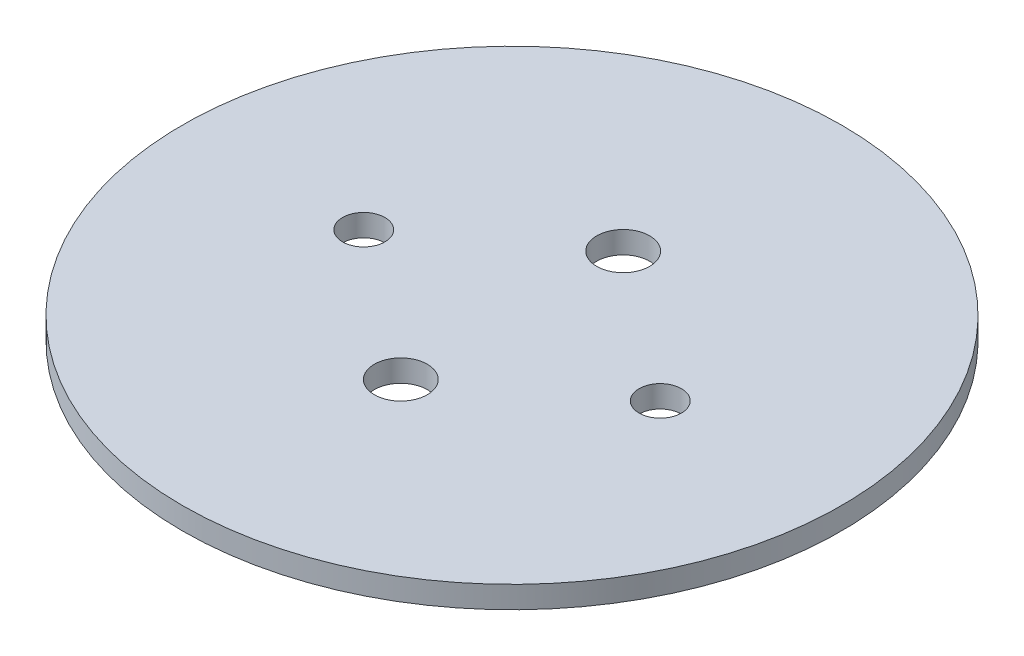
ISO-10303-21;
HEADER;
FILE_DESCRIPTION(('STEP AP214'),'2;1');
FILE_NAME('part.step','',(''),(''),'','','');
FILE_SCHEMA(('AUTOMOTIVE_DESIGN { 1 0 10303 214 1 1 1 1 }'));
ENDSEC;
DATA;
#1=APPLICATION_CONTEXT('core data for automotive mechanical design processes');
#2=APPLICATION_PROTOCOL_DEFINITION('international standard','automotive_design',2000,#1);
#3=PRODUCT_CONTEXT('',#1,'mechanical');
#4=PRODUCT('Part','Part','',(#3));
#5=PRODUCT_RELATED_PRODUCT_CATEGORY('part','',(#4));
#6=PRODUCT_DEFINITION_FORMATION('','',#4);
#7=PRODUCT_DEFINITION_CONTEXT('part definition',#1,'design');
#8=PRODUCT_DEFINITION('design','',#6,#7);
#9=PRODUCT_DEFINITION_SHAPE('','',#8);
#10=(LENGTH_UNIT() NAMED_UNIT(*) SI_UNIT(.MILLI.,.METRE.));
#11=(NAMED_UNIT(*) PLANE_ANGLE_UNIT() SI_UNIT($,.RADIAN.));
#12=(NAMED_UNIT(*) SI_UNIT($,.STERADIAN.) SOLID_ANGLE_UNIT());
#13=UNCERTAINTY_MEASURE_WITH_UNIT(LENGTH_MEASURE(1.E-05),#10,'distance_accuracy_value','');
#14=(GEOMETRIC_REPRESENTATION_CONTEXT(3) GLOBAL_UNCERTAINTY_ASSIGNED_CONTEXT((#13)) GLOBAL_UNIT_ASSIGNED_CONTEXT((#10,
#11,#12)) REPRESENTATION_CONTEXT('',''));
#15=CARTESIAN_POINT('',(0.,0.,0.));
#16=DIRECTION('',(0.,0.,1.));
#17=DIRECTION('',(1.,0.,0.));
#18=AXIS2_PLACEMENT_3D('',#15,#16,#17);
#19=CARTESIAN_POINT('',(0.,3.302,0.));
#20=DIRECTION('',(0.,1.,0.));
#21=DIRECTION('',(0.,0.,1.));
#22=AXIS2_PLACEMENT_3D('',#19,#20,#21);
#23=PLANE('',#22);
#24=CARTESIAN_POINT('',(0.,3.302,16.66875));
#25=DIRECTION('',(0.,1.,0.));
#26=DIRECTION('',(0.,0.,1.));
#27=AXIS2_PLACEMENT_3D('',#24,#25,#26);
#28=CIRCLE('',#27,3.96875);
#29=CARTESIAN_POINT('',(0.,3.302,20.6375));
#30=VERTEX_POINT('',#29);
#31=EDGE_CURVE('E63',#30,#30,#28,.T.);
#32=ORIENTED_EDGE('',*,*,#31,.F.);
#33=EDGE_LOOP('',(#32));
#34=FACE_BOUND('',#33,.T.);
#35=CARTESIAN_POINT('',(22.225,3.302,0.));
#36=DIRECTION('',(0.,1.,0.));
#37=DIRECTION('',(0.,0.,1.));
#38=AXIS2_PLACEMENT_3D('',#35,#36,#37);
#39=CIRCLE('',#38,3.175);
#40=CARTESIAN_POINT('',(22.225,3.302,3.175));
#41=VERTEX_POINT('',#40);
#42=EDGE_CURVE('E52',#41,#41,#39,.T.);
#43=ORIENTED_EDGE('',*,*,#42,.F.);
#44=EDGE_LOOP('',(#43));
#45=FACE_BOUND('',#44,.T.);
#46=CARTESIAN_POINT('',(0.,3.302,0.));
#47=DIRECTION('',(0.,1.,0.));
#48=DIRECTION('',(0.,0.,1.));
#49=AXIS2_PLACEMENT_3D('',#46,#47,#48);
#50=CIRCLE('',#49,49.403);
#51=CARTESIAN_POINT('',(0.,3.302,49.403));
#52=VERTEX_POINT('',#51);
#53=EDGE_CURVE('E10',#52,#52,#50,.T.);
#54=ORIENTED_EDGE('',*,*,#53,.T.);
#55=EDGE_LOOP('',(#54));
#56=FACE_BOUND('',#55,.T.);
#57=CARTESIAN_POINT('',(-22.225,3.302,0.));
#58=DIRECTION('',(0.,1.,0.));
#59=DIRECTION('',(0.,0.,1.));
#60=AXIS2_PLACEMENT_3D('',#57,#58,#59);
#61=CIRCLE('',#60,3.175);
#62=CARTESIAN_POINT('',(-22.225,3.302,3.175));
#63=VERTEX_POINT('',#62);
#64=EDGE_CURVE('E57',#63,#63,#61,.T.);
#65=ORIENTED_EDGE('',*,*,#64,.F.);
#66=EDGE_LOOP('',(#65));
#67=FACE_BOUND('',#66,.T.);
#68=CARTESIAN_POINT('',(0.,3.302,-16.66875));
#69=DIRECTION('',(0.,1.,0.));
#70=DIRECTION('',(0.,0.,1.));
#71=AXIS2_PLACEMENT_3D('',#68,#69,#70);
#72=CIRCLE('',#71,3.96875);
#73=CARTESIAN_POINT('',(0.,3.302,-12.7));
#74=VERTEX_POINT('',#73);
#75=EDGE_CURVE('E69',#74,#74,#72,.T.);
#76=ORIENTED_EDGE('',*,*,#75,.F.);
#77=EDGE_LOOP('',(#76));
#78=FACE_BOUND('',#77,.T.);
#79=ADVANCED_FACE('F41',(#34,#45,#56,#67,#78),#23,.T.);
#80=CARTESIAN_POINT('',(0.,0.,0.));
#81=DIRECTION('',(0.,1.,0.));
#82=DIRECTION('',(0.,0.,1.));
#83=AXIS2_PLACEMENT_3D('',#80,#81,#82);
#84=PLANE('',#83);
#85=CARTESIAN_POINT('',(0.,0.,0.));
#86=DIRECTION('',(0.,1.,0.));
#87=DIRECTION('',(0.,0.,1.));
#88=AXIS2_PLACEMENT_3D('',#85,#86,#87);
#89=CIRCLE('',#88,49.403);
#90=CARTESIAN_POINT('',(0.,0.,49.403));
#91=VERTEX_POINT('',#90);
#92=EDGE_CURVE('E45',#91,#91,#89,.T.);
#93=ORIENTED_EDGE('',*,*,#92,.F.);
#94=EDGE_LOOP('',(#93));
#95=FACE_BOUND('',#94,.T.);
#96=CARTESIAN_POINT('',(22.225,0.,0.));
#97=DIRECTION('',(0.,1.,0.));
#98=DIRECTION('',(0.,0.,1.));
#99=AXIS2_PLACEMENT_3D('',#96,#97,#98);
#100=CIRCLE('',#99,3.175);
#101=CARTESIAN_POINT('',(22.225,0.,3.175));
#102=VERTEX_POINT('',#101);
#103=EDGE_CURVE('E54',#102,#102,#100,.T.);
#104=ORIENTED_EDGE('',*,*,#103,.T.);
#105=EDGE_LOOP('',(#104));
#106=FACE_BOUND('',#105,.T.);
#107=CARTESIAN_POINT('',(-22.225,0.,0.));
#108=DIRECTION('',(0.,1.,0.));
#109=DIRECTION('',(0.,0.,1.));
#110=AXIS2_PLACEMENT_3D('',#107,#108,#109);
#111=CIRCLE('',#110,3.175);
#112=CARTESIAN_POINT('',(-22.225,0.,3.175));
#113=VERTEX_POINT('',#112);
#114=EDGE_CURVE('E60',#113,#113,#111,.T.);
#115=ORIENTED_EDGE('',*,*,#114,.T.);
#116=EDGE_LOOP('',(#115));
#117=FACE_BOUND('',#116,.T.);
#118=CARTESIAN_POINT('',(0.,0.,16.66875));
#119=DIRECTION('',(0.,1.,0.));
#120=DIRECTION('',(0.,0.,1.));
#121=AXIS2_PLACEMENT_3D('',#118,#119,#120);
#122=CIRCLE('',#121,3.96875);
#123=CARTESIAN_POINT('',(0.,0.,20.6375));
#124=VERTEX_POINT('',#123);
#125=EDGE_CURVE('E66',#124,#124,#122,.T.);
#126=ORIENTED_EDGE('',*,*,#125,.T.);
#127=EDGE_LOOP('',(#126));
#128=FACE_BOUND('',#127,.T.);
#129=CARTESIAN_POINT('',(0.,0.,-16.66875));
#130=DIRECTION('',(0.,1.,0.));
#131=DIRECTION('',(0.,0.,1.));
#132=AXIS2_PLACEMENT_3D('',#129,#130,#131);
#133=CIRCLE('',#132,3.96875);
#134=CARTESIAN_POINT('',(0.,0.,-12.7));
#135=VERTEX_POINT('',#134);
#136=EDGE_CURVE('E72',#135,#135,#133,.T.);
#137=ORIENTED_EDGE('',*,*,#136,.T.);
#138=EDGE_LOOP('',(#137));
#139=FACE_BOUND('',#138,.T.);
#140=ADVANCED_FACE('F82',(#95,#106,#117,#128,#139),#84,.F.);
#141=CARTESIAN_POINT('',(0.,3.302,0.));
#142=DIRECTION('',(0.,-1.,0.));
#143=DIRECTION('',(0.,0.,-1.));
#144=AXIS2_PLACEMENT_3D('',#141,#142,#143);
#145=CYLINDRICAL_SURFACE('',#144,49.403);
#146=ORIENTED_EDGE('',*,*,#53,.F.);
#147=EDGE_LOOP('',(#146));
#148=FACE_BOUND('',#147,.T.);
#149=ORIENTED_EDGE('',*,*,#92,.T.);
#150=EDGE_LOOP('',(#149));
#151=FACE_BOUND('',#150,.T.);
#152=ADVANCED_FACE('F43',(#148,#151),#145,.T.);
#153=CARTESIAN_POINT('',(22.225,3.302,0.));
#154=DIRECTION('',(0.,-1.,0.));
#155=DIRECTION('',(0.,0.,-1.));
#156=AXIS2_PLACEMENT_3D('',#153,#154,#155);
#157=CYLINDRICAL_SURFACE('',#156,3.175);
#158=ORIENTED_EDGE('',*,*,#42,.T.);
#159=EDGE_LOOP('',(#158));
#160=FACE_BOUND('',#159,.T.);
#161=ORIENTED_EDGE('',*,*,#103,.F.);
#162=EDGE_LOOP('',(#161));
#163=FACE_BOUND('',#162,.T.);
#164=ADVANCED_FACE('F92',(#160,#163),#157,.F.);
#165=CARTESIAN_POINT('',(-22.225,3.302,0.));
#166=DIRECTION('',(0.,-1.,0.));
#167=DIRECTION('',(0.,0.,-1.));
#168=AXIS2_PLACEMENT_3D('',#165,#166,#167);
#169=CYLINDRICAL_SURFACE('',#168,3.175);
#170=ORIENTED_EDGE('',*,*,#64,.T.);
#171=EDGE_LOOP('',(#170));
#172=FACE_BOUND('',#171,.T.);
#173=ORIENTED_EDGE('',*,*,#114,.F.);
#174=EDGE_LOOP('',(#173));
#175=FACE_BOUND('',#174,.T.);
#176=ADVANCED_FACE('F95',(#172,#175),#169,.F.);
#177=CARTESIAN_POINT('',(0.,3.302,16.66875));
#178=DIRECTION('',(0.,-1.,0.));
#179=DIRECTION('',(0.,0.,-1.));
#180=AXIS2_PLACEMENT_3D('',#177,#178,#179);
#181=CYLINDRICAL_SURFACE('',#180,3.96875);
#182=ORIENTED_EDGE('',*,*,#31,.T.);
#183=EDGE_LOOP('',(#182));
#184=FACE_BOUND('',#183,.T.);
#185=ORIENTED_EDGE('',*,*,#125,.F.);
#186=EDGE_LOOP('',(#185));
#187=FACE_BOUND('',#186,.T.);
#188=ADVANCED_FACE('F99',(#184,#187),#181,.F.);
#189=CARTESIAN_POINT('',(0.,3.302,-16.66875));
#190=DIRECTION('',(0.,-1.,0.));
#191=DIRECTION('',(0.,0.,-1.));
#192=AXIS2_PLACEMENT_3D('',#189,#190,#191);
#193=CYLINDRICAL_SURFACE('',#192,3.96875);
#194=ORIENTED_EDGE('',*,*,#75,.T.);
#195=EDGE_LOOP('',(#194));
#196=FACE_BOUND('',#195,.T.);
#197=ORIENTED_EDGE('',*,*,#136,.F.);
#198=EDGE_LOOP('',(#197));
#199=FACE_BOUND('',#198,.T.);
#200=ADVANCED_FACE('F78',(#196,#199),#193,.F.);
#201=CLOSED_SHELL('',(#79,#140,#152,#164,#176,#188,#200));
#202=MANIFOLD_SOLID_BREP('B2',#201);
#203=ADVANCED_BREP_SHAPE_REPRESENTATION('',(#18,#202),#14);
#204=SHAPE_DEFINITION_REPRESENTATION(#9,#203);
ENDSEC;
END-ISO-10303-21;
